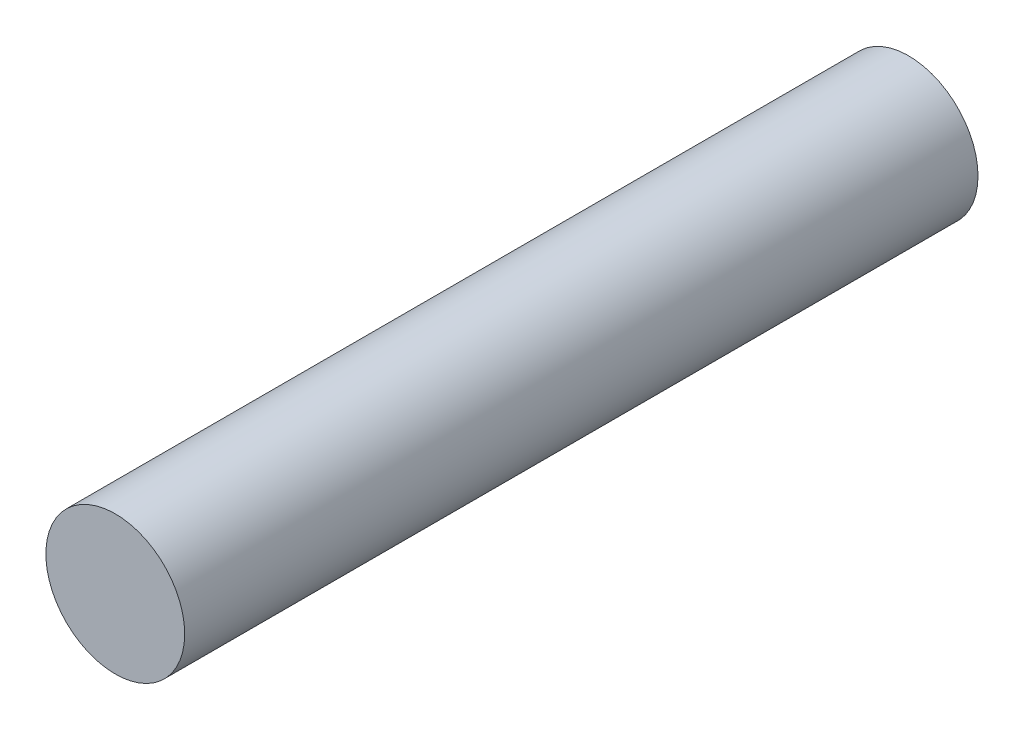
ISO-10303-21;
HEADER;
FILE_DESCRIPTION(('STEP AP214'),'2;1');
FILE_NAME('part.step','',(''),(''),'','','');
FILE_SCHEMA(('AUTOMOTIVE_DESIGN { 1 0 10303 214 1 1 1 1 }'));
ENDSEC;
DATA;
#1=APPLICATION_CONTEXT('core data for automotive mechanical design processes');
#2=APPLICATION_PROTOCOL_DEFINITION('international standard','automotive_design',2000,#1);
#3=PRODUCT_CONTEXT('',#1,'mechanical');
#4=PRODUCT('Part','Part','',(#3));
#5=PRODUCT_RELATED_PRODUCT_CATEGORY('part','',(#4));
#6=PRODUCT_DEFINITION_FORMATION('','',#4);
#7=PRODUCT_DEFINITION_CONTEXT('part definition',#1,'design');
#8=PRODUCT_DEFINITION('design','',#6,#7);
#9=PRODUCT_DEFINITION_SHAPE('','',#8);
#10=(LENGTH_UNIT() NAMED_UNIT(*) SI_UNIT(.MILLI.,.METRE.));
#11=(NAMED_UNIT(*) PLANE_ANGLE_UNIT() SI_UNIT($,.RADIAN.));
#12=(NAMED_UNIT(*) SI_UNIT($,.STERADIAN.) SOLID_ANGLE_UNIT());
#13=UNCERTAINTY_MEASURE_WITH_UNIT(LENGTH_MEASURE(1.E-05),#10,'distance_accuracy_value','');
#14=(GEOMETRIC_REPRESENTATION_CONTEXT(3) GLOBAL_UNCERTAINTY_ASSIGNED_CONTEXT((#13)) GLOBAL_UNIT_ASSIGNED_CONTEXT((#10,
#11,#12)) REPRESENTATION_CONTEXT('',''));
#15=CARTESIAN_POINT('',(0.,0.,0.));
#16=DIRECTION('',(0.,0.,1.));
#17=DIRECTION('',(1.,0.,0.));
#18=AXIS2_PLACEMENT_3D('',#15,#16,#17);
#19=CARTESIAN_POINT('',(0.,0.,800.));
#20=DIRECTION('',(0.,0.,-1.));
#21=DIRECTION('',(-1.,0.,0.));
#22=AXIS2_PLACEMENT_3D('',#19,#20,#21);
#23=CYLINDRICAL_SURFACE('',#22,70.);
#24=CARTESIAN_POINT('',(0.,0.,800.));
#25=DIRECTION('',(0.,0.,1.));
#26=DIRECTION('',(1.,0.,0.));
#27=AXIS2_PLACEMENT_3D('',#24,#25,#26);
#28=CIRCLE('',#27,70.);
#29=CARTESIAN_POINT('',(70.,0.,800.));
#30=VERTEX_POINT('',#29);
#31=EDGE_CURVE('E12',#30,#30,#28,.T.);
#32=ORIENTED_EDGE('',*,*,#31,.F.);
#33=EDGE_LOOP('',(#32));
#34=FACE_BOUND('',#33,.T.);
#35=CARTESIAN_POINT('',(0.,0.,0.));
#36=DIRECTION('',(0.,0.,1.));
#37=DIRECTION('',(1.,0.,0.));
#38=AXIS2_PLACEMENT_3D('',#35,#36,#37);
#39=CIRCLE('',#38,70.);
#40=CARTESIAN_POINT('',(70.,0.,0.));
#41=VERTEX_POINT('',#40);
#42=EDGE_CURVE('E46',#41,#41,#39,.T.);
#43=ORIENTED_EDGE('',*,*,#42,.T.);
#44=EDGE_LOOP('',(#43));
#45=FACE_BOUND('',#44,.T.);
#46=ADVANCED_FACE('F43',(#34,#45),#23,.T.);
#47=CARTESIAN_POINT('',(0.,0.,800.));
#48=DIRECTION('',(0.,0.,1.));
#49=DIRECTION('',(1.,0.,0.));
#50=AXIS2_PLACEMENT_3D('',#47,#48,#49);
#51=PLANE('',#50);
#52=ORIENTED_EDGE('',*,*,#31,.T.);
#53=EDGE_LOOP('',(#52));
#54=FACE_BOUND('',#53,.T.);
#55=ADVANCED_FACE('F58',(#54),#51,.T.);
#56=CARTESIAN_POINT('',(0.,0.,0.));
#57=DIRECTION('',(0.,0.,1.));
#58=DIRECTION('',(1.,0.,0.));
#59=AXIS2_PLACEMENT_3D('',#56,#57,#58);
#60=PLANE('',#59);
#61=ORIENTED_EDGE('',*,*,#42,.F.);
#62=EDGE_LOOP('',(#61));
#63=FACE_BOUND('',#62,.T.);
#64=ADVANCED_FACE('F56',(#63),#60,.F.);
#65=CLOSED_SHELL('',(#46,#55,#64));
#66=MANIFOLD_SOLID_BREP('B2',#65);
#67=ADVANCED_BREP_SHAPE_REPRESENTATION('',(#18,#66),#14);
#68=SHAPE_DEFINITION_REPRESENTATION(#9,#67);
ENDSEC;
END-ISO-10303-21;
